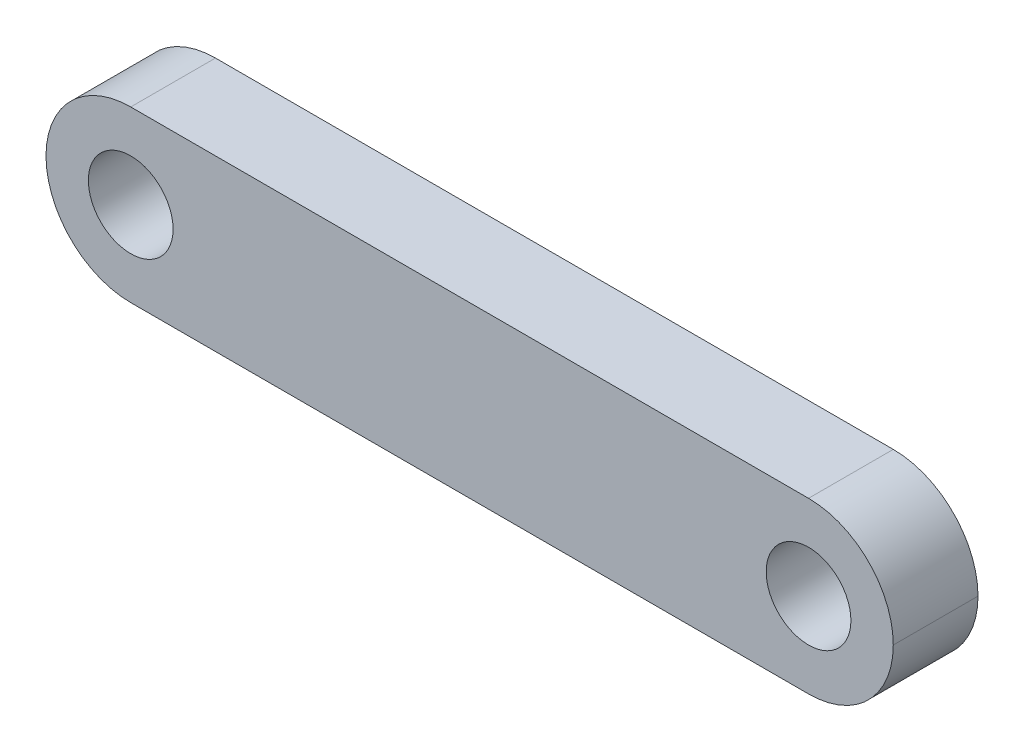
ISO-10303-21;
HEADER;
FILE_DESCRIPTION(('STEP AP214'),'2;1');
FILE_NAME('part.step','',(''),(''),'','','');
FILE_SCHEMA(('AUTOMOTIVE_DESIGN { 1 0 10303 214 1 1 1 1 }'));
ENDSEC;
DATA;
#1=APPLICATION_CONTEXT('core data for automotive mechanical design processes');
#2=APPLICATION_PROTOCOL_DEFINITION('international standard','automotive_design',2000,#1);
#3=PRODUCT_CONTEXT('',#1,'mechanical');
#4=PRODUCT('Part','Part','',(#3));
#5=PRODUCT_RELATED_PRODUCT_CATEGORY('part','',(#4));
#6=PRODUCT_DEFINITION_FORMATION('','',#4);
#7=PRODUCT_DEFINITION_CONTEXT('part definition',#1,'design');
#8=PRODUCT_DEFINITION('design','',#6,#7);
#9=PRODUCT_DEFINITION_SHAPE('','',#8);
#10=(LENGTH_UNIT() NAMED_UNIT(*) SI_UNIT(.MILLI.,.METRE.));
#11=(NAMED_UNIT(*) PLANE_ANGLE_UNIT() SI_UNIT($,.RADIAN.));
#12=(NAMED_UNIT(*) SI_UNIT($,.STERADIAN.) SOLID_ANGLE_UNIT());
#13=UNCERTAINTY_MEASURE_WITH_UNIT(LENGTH_MEASURE(1.E-05),#10,'distance_accuracy_value','');
#14=(GEOMETRIC_REPRESENTATION_CONTEXT(3) GLOBAL_UNCERTAINTY_ASSIGNED_CONTEXT((#13)) GLOBAL_UNIT_ASSIGNED_CONTEXT((#10,
#11,#12)) REPRESENTATION_CONTEXT('',''));
#15=CARTESIAN_POINT('',(0.,0.,0.));
#16=DIRECTION('',(0.,0.,1.));
#17=DIRECTION('',(1.,0.,0.));
#18=AXIS2_PLACEMENT_3D('',#15,#16,#17);
#19=CARTESIAN_POINT('',(0.,0.,10.));
#20=DIRECTION('',(0.,1.,0.));
#21=DIRECTION('',(0.,0.,1.));
#22=AXIS2_PLACEMENT_3D('',#19,#20,#21);
#23=PLANE('',#22);
#24=DIRECTION('',(1.,0.,0.));
#25=VECTOR('',#24,1.);
#26=CARTESIAN_POINT('',(0.,0.,0.));
#27=LINE('',#26,#25);
#28=CARTESIAN_POINT('',(10.,0.,0.));
#29=VERTEX_POINT('',#28);
#30=CARTESIAN_POINT('',(90.,0.,0.));
#31=VERTEX_POINT('',#30);
#32=EDGE_CURVE('E124',#29,#31,#27,.T.);
#33=ORIENTED_EDGE('',*,*,#32,.T.);
#34=DIRECTION('',(0.,0.,-1.));
#35=VECTOR('',#34,1.);
#36=CARTESIAN_POINT('',(90.,0.,10.));
#37=LINE('',#36,#35);
#38=CARTESIAN_POINT('',(90.,0.,10.));
#39=VERTEX_POINT('',#38);
#40=EDGE_CURVE('E11',#31,#39,#37,.F.);
#41=ORIENTED_EDGE('',*,*,#40,.T.);
#42=DIRECTION('',(1.,0.,0.));
#43=VECTOR('',#42,1.);
#44=CARTESIAN_POINT('',(0.,0.,10.));
#45=LINE('',#44,#43);
#46=CARTESIAN_POINT('',(10.,0.,10.));
#47=VERTEX_POINT('',#46);
#48=EDGE_CURVE('E123',#47,#39,#45,.T.);
#49=ORIENTED_EDGE('',*,*,#48,.F.);
#50=DIRECTION('',(0.,0.,-1.));
#51=VECTOR('',#50,1.);
#52=CARTESIAN_POINT('',(10.,0.,10.));
#53=LINE('',#52,#51);
#54=EDGE_CURVE('E52',#47,#29,#53,.T.);
#55=ORIENTED_EDGE('',*,*,#54,.T.);
#56=EDGE_LOOP('',(#33,#41,#49,#55));
#57=FACE_BOUND('',#56,.T.);
#58=ADVANCED_FACE('F43',(#57),#23,.F.);
#59=CARTESIAN_POINT('',(0.,20.,10.));
#60=DIRECTION('',(0.,-1.,0.));
#61=DIRECTION('',(0.,0.,-1.));
#62=AXIS2_PLACEMENT_3D('',#59,#60,#61);
#63=PLANE('',#62);
#64=DIRECTION('',(-1.,0.,0.));
#65=VECTOR('',#64,1.);
#66=CARTESIAN_POINT('',(0.,20.,10.));
#67=LINE('',#66,#65);
#68=CARTESIAN_POINT('',(90.,20.,10.));
#69=VERTEX_POINT('',#68);
#70=CARTESIAN_POINT('',(10.,20.,10.));
#71=VERTEX_POINT('',#70);
#72=EDGE_CURVE('E117',#69,#71,#67,.T.);
#73=ORIENTED_EDGE('',*,*,#72,.F.);
#74=DIRECTION('',(0.,0.,-1.));
#75=VECTOR('',#74,1.);
#76=CARTESIAN_POINT('',(90.,20.,10.));
#77=LINE('',#76,#75);
#78=CARTESIAN_POINT('',(90.,20.,0.));
#79=VERTEX_POINT('',#78);
#80=EDGE_CURVE('E102',#69,#79,#77,.T.);
#81=ORIENTED_EDGE('',*,*,#80,.T.);
#82=DIRECTION('',(-1.,0.,0.));
#83=VECTOR('',#82,1.);
#84=CARTESIAN_POINT('',(0.,20.,0.));
#85=LINE('',#84,#83);
#86=CARTESIAN_POINT('',(10.,20.,0.));
#87=VERTEX_POINT('',#86);
#88=EDGE_CURVE('E114',#79,#87,#85,.T.);
#89=ORIENTED_EDGE('',*,*,#88,.T.);
#90=DIRECTION('',(0.,0.,-1.));
#91=VECTOR('',#90,1.);
#92=CARTESIAN_POINT('',(10.,20.,10.));
#93=LINE('',#92,#91);
#94=EDGE_CURVE('E119',#87,#71,#93,.F.);
#95=ORIENTED_EDGE('',*,*,#94,.T.);
#96=EDGE_LOOP('',(#73,#81,#89,#95));
#97=FACE_BOUND('',#96,.T.);
#98=ADVANCED_FACE('F113',(#97),#63,.F.);
#99=CARTESIAN_POINT('',(0.,0.,10.));
#100=DIRECTION('',(0.,0.,-1.));
#101=DIRECTION('',(-1.,0.,0.));
#102=AXIS2_PLACEMENT_3D('',#99,#100,#101);
#103=PLANE('',#102);
#104=CARTESIAN_POINT('',(90.,10.,10.));
#105=DIRECTION('',(0.,0.,1.));
#106=DIRECTION('',(1.,0.,0.));
#107=AXIS2_PLACEMENT_3D('',#104,#105,#106);
#108=CIRCLE('',#107,5.);
#109=CARTESIAN_POINT('',(95.,10.,10.));
#110=VERTEX_POINT('',#109);
#111=EDGE_CURVE('E157',#110,#110,#108,.T.);
#112=ORIENTED_EDGE('',*,*,#111,.F.);
#113=EDGE_LOOP('',(#112));
#114=FACE_BOUND('',#113,.T.);
#115=CARTESIAN_POINT('',(10.,10.,10.));
#116=DIRECTION('',(0.,0.,1.));
#117=DIRECTION('',(1.,0.,0.));
#118=AXIS2_PLACEMENT_3D('',#115,#116,#117);
#119=CIRCLE('',#118,5.);
#120=CARTESIAN_POINT('',(15.,10.,10.));
#121=VERTEX_POINT('',#120);
#122=EDGE_CURVE('E149',#121,#121,#119,.T.);
#123=ORIENTED_EDGE('',*,*,#122,.F.);
#124=EDGE_LOOP('',(#123));
#125=FACE_BOUND('',#124,.T.);
#126=CARTESIAN_POINT('',(90.,10.,10.));
#127=DIRECTION('',(0.,0.,-1.));
#128=DIRECTION('',(-1.,0.,0.));
#129=AXIS2_PLACEMENT_3D('',#126,#127,#128);
#130=CIRCLE('',#129,10.);
#131=CARTESIAN_POINT('',(100.,10.,10.));
#132=VERTEX_POINT('',#131);
#133=EDGE_CURVE('E60',#39,#132,#130,.F.);
#134=ORIENTED_EDGE('',*,*,#133,.T.);
#135=CARTESIAN_POINT('',(90.,10.,10.));
#136=DIRECTION('',(0.,0.,-1.));
#137=DIRECTION('',(-1.,0.,0.));
#138=AXIS2_PLACEMENT_3D('',#135,#136,#137);
#139=CIRCLE('',#138,10.);
#140=EDGE_CURVE('E139',#132,#69,#139,.F.);
#141=ORIENTED_EDGE('',*,*,#140,.T.);
#142=ORIENTED_EDGE('',*,*,#72,.T.);
#143=CARTESIAN_POINT('',(10.,10.,10.));
#144=DIRECTION('',(0.,0.,-1.));
#145=DIRECTION('',(-1.,0.,0.));
#146=AXIS2_PLACEMENT_3D('',#143,#144,#145);
#147=CIRCLE('',#146,10.);
#148=CARTESIAN_POINT('',(0.,10.,10.));
#149=VERTEX_POINT('',#148);
#150=EDGE_CURVE('E107',#71,#149,#147,.F.);
#151=ORIENTED_EDGE('',*,*,#150,.T.);
#152=CARTESIAN_POINT('',(10.,10.,10.));
#153=DIRECTION('',(0.,0.,-1.));
#154=DIRECTION('',(-1.,0.,0.));
#155=AXIS2_PLACEMENT_3D('',#152,#153,#154);
#156=CIRCLE('',#155,10.);
#157=EDGE_CURVE('E136',#149,#47,#156,.F.);
#158=ORIENTED_EDGE('',*,*,#157,.T.);
#159=ORIENTED_EDGE('',*,*,#48,.T.);
#160=EDGE_LOOP('',(#134,#141,#142,#151,#158,#159));
#161=FACE_BOUND('',#160,.T.);
#162=ADVANCED_FACE('F160',(#114,#125,#161),#103,.F.);
#163=CARTESIAN_POINT('',(0.,0.,0.));
#164=DIRECTION('',(0.,0.,-1.));
#165=DIRECTION('',(-1.,0.,0.));
#166=AXIS2_PLACEMENT_3D('',#163,#164,#165);
#167=PLANE('',#166);
#168=CARTESIAN_POINT('',(90.,10.,0.));
#169=DIRECTION('',(0.,0.,1.));
#170=DIRECTION('',(1.,0.,0.));
#171=AXIS2_PLACEMENT_3D('',#168,#169,#170);
#172=CIRCLE('',#171,5.);
#173=CARTESIAN_POINT('',(95.,10.,0.));
#174=VERTEX_POINT('',#173);
#175=EDGE_CURVE('E154',#174,#174,#172,.T.);
#176=ORIENTED_EDGE('',*,*,#175,.T.);
#177=EDGE_LOOP('',(#176));
#178=FACE_BOUND('',#177,.T.);
#179=CARTESIAN_POINT('',(10.,10.,0.));
#180=DIRECTION('',(0.,0.,1.));
#181=DIRECTION('',(1.,0.,0.));
#182=AXIS2_PLACEMENT_3D('',#179,#180,#181);
#183=CIRCLE('',#182,5.);
#184=CARTESIAN_POINT('',(15.,10.,0.));
#185=VERTEX_POINT('',#184);
#186=EDGE_CURVE('E144',#185,#185,#183,.T.);
#187=ORIENTED_EDGE('',*,*,#186,.T.);
#188=EDGE_LOOP('',(#187));
#189=FACE_BOUND('',#188,.T.);
#190=ORIENTED_EDGE('',*,*,#88,.F.);
#191=CARTESIAN_POINT('',(90.,10.,0.));
#192=DIRECTION('',(0.,0.,-1.));
#193=DIRECTION('',(-1.,0.,0.));
#194=AXIS2_PLACEMENT_3D('',#191,#192,#193);
#195=CIRCLE('',#194,10.);
#196=CARTESIAN_POINT('',(100.,10.,0.));
#197=VERTEX_POINT('',#196);
#198=EDGE_CURVE('E98',#79,#197,#195,.T.);
#199=ORIENTED_EDGE('',*,*,#198,.T.);
#200=CARTESIAN_POINT('',(90.,10.,0.));
#201=DIRECTION('',(0.,0.,-1.));
#202=DIRECTION('',(-1.,0.,0.));
#203=AXIS2_PLACEMENT_3D('',#200,#201,#202);
#204=CIRCLE('',#203,10.);
#205=EDGE_CURVE('E108',#197,#31,#204,.T.);
#206=ORIENTED_EDGE('',*,*,#205,.T.);
#207=ORIENTED_EDGE('',*,*,#32,.F.);
#208=CARTESIAN_POINT('',(10.,10.,0.));
#209=DIRECTION('',(0.,0.,-1.));
#210=DIRECTION('',(-1.,0.,0.));
#211=AXIS2_PLACEMENT_3D('',#208,#209,#210);
#212=CIRCLE('',#211,10.);
#213=CARTESIAN_POINT('',(0.,10.,0.));
#214=VERTEX_POINT('',#213);
#215=EDGE_CURVE('E132',#29,#214,#212,.T.);
#216=ORIENTED_EDGE('',*,*,#215,.T.);
#217=CARTESIAN_POINT('',(10.,10.,0.));
#218=DIRECTION('',(0.,0.,-1.));
#219=DIRECTION('',(-1.,0.,0.));
#220=AXIS2_PLACEMENT_3D('',#217,#218,#219);
#221=CIRCLE('',#220,10.);
#222=EDGE_CURVE('E118',#214,#87,#221,.T.);
#223=ORIENTED_EDGE('',*,*,#222,.T.);
#224=EDGE_LOOP('',(#190,#199,#206,#207,#216,#223));
#225=FACE_BOUND('',#224,.T.);
#226=ADVANCED_FACE('F121',(#178,#189,#225),#167,.T.);
#227=CARTESIAN_POINT('',(90.,10.,10.));
#228=DIRECTION('',(0.,0.,-1.));
#229=DIRECTION('',(-1.,0.,0.));
#230=AXIS2_PLACEMENT_3D('',#227,#228,#229);
#231=CYLINDRICAL_SURFACE('',#230,10.);
#232=DIRECTION('',(0.,0.,-1.));
#233=VECTOR('',#232,1.);
#234=CARTESIAN_POINT('',(100.,10.,10.));
#235=LINE('',#234,#233);
#236=EDGE_CURVE('E103',#132,#197,#235,.T.);
#237=ORIENTED_EDGE('',*,*,#236,.F.);
#238=ORIENTED_EDGE('',*,*,#133,.F.);
#239=ORIENTED_EDGE('',*,*,#40,.F.);
#240=ORIENTED_EDGE('',*,*,#205,.F.);
#241=EDGE_LOOP('',(#237,#238,#239,#240));
#242=FACE_BOUND('',#241,.T.);
#243=ADVANCED_FACE('F166',(#242),#231,.T.);
#244=CARTESIAN_POINT('',(90.,10.,10.));
#245=DIRECTION('',(0.,0.,-1.));
#246=DIRECTION('',(-1.,0.,0.));
#247=AXIS2_PLACEMENT_3D('',#244,#245,#246);
#248=CYLINDRICAL_SURFACE('',#247,10.);
#249=ORIENTED_EDGE('',*,*,#140,.F.);
#250=ORIENTED_EDGE('',*,*,#236,.T.);
#251=ORIENTED_EDGE('',*,*,#198,.F.);
#252=ORIENTED_EDGE('',*,*,#80,.F.);
#253=EDGE_LOOP('',(#249,#250,#251,#252));
#254=FACE_BOUND('',#253,.T.);
#255=ADVANCED_FACE('F101',(#254),#248,.T.);
#256=CARTESIAN_POINT('',(10.,10.,10.));
#257=DIRECTION('',(0.,0.,-1.));
#258=DIRECTION('',(-1.,0.,0.));
#259=AXIS2_PLACEMENT_3D('',#256,#257,#258);
#260=CYLINDRICAL_SURFACE('',#259,10.);
#261=DIRECTION('',(0.,0.,-1.));
#262=VECTOR('',#261,1.);
#263=CARTESIAN_POINT('',(0.,10.,10.));
#264=LINE('',#263,#262);
#265=EDGE_CURVE('E47',#149,#214,#264,.T.);
#266=ORIENTED_EDGE('',*,*,#265,.F.);
#267=ORIENTED_EDGE('',*,*,#150,.F.);
#268=ORIENTED_EDGE('',*,*,#94,.F.);
#269=ORIENTED_EDGE('',*,*,#222,.F.);
#270=EDGE_LOOP('',(#266,#267,#268,#269));
#271=FACE_BOUND('',#270,.T.);
#272=ADVANCED_FACE('F45',(#271),#260,.T.);
#273=CARTESIAN_POINT('',(10.,10.,10.));
#274=DIRECTION('',(0.,0.,-1.));
#275=DIRECTION('',(-1.,0.,0.));
#276=AXIS2_PLACEMENT_3D('',#273,#274,#275);
#277=CYLINDRICAL_SURFACE('',#276,10.);
#278=ORIENTED_EDGE('',*,*,#157,.F.);
#279=ORIENTED_EDGE('',*,*,#265,.T.);
#280=ORIENTED_EDGE('',*,*,#215,.F.);
#281=ORIENTED_EDGE('',*,*,#54,.F.);
#282=EDGE_LOOP('',(#278,#279,#280,#281));
#283=FACE_BOUND('',#282,.T.);
#284=ADVANCED_FACE('F163',(#283),#277,.T.);
#285=CARTESIAN_POINT('',(10.,10.,0.));
#286=DIRECTION('',(0.,0.,1.));
#287=DIRECTION('',(1.,0.,0.));
#288=AXIS2_PLACEMENT_3D('',#285,#286,#287);
#289=CYLINDRICAL_SURFACE('',#288,5.);
#290=ORIENTED_EDGE('',*,*,#186,.F.);
#291=EDGE_LOOP('',(#290));
#292=FACE_BOUND('',#291,.T.);
#293=ORIENTED_EDGE('',*,*,#122,.T.);
#294=EDGE_LOOP('',(#293));
#295=FACE_BOUND('',#294,.T.);
#296=ADVANCED_FACE('F186',(#292,#295),#289,.F.);
#297=CARTESIAN_POINT('',(90.,10.,0.));
#298=DIRECTION('',(0.,0.,1.));
#299=DIRECTION('',(1.,0.,0.));
#300=AXIS2_PLACEMENT_3D('',#297,#298,#299);
#301=CYLINDRICAL_SURFACE('',#300,5.);
#302=ORIENTED_EDGE('',*,*,#175,.F.);
#303=EDGE_LOOP('',(#302));
#304=FACE_BOUND('',#303,.T.);
#305=ORIENTED_EDGE('',*,*,#111,.T.);
#306=EDGE_LOOP('',(#305));
#307=FACE_BOUND('',#306,.T.);
#308=ADVANCED_FACE('F189',(#304,#307),#301,.F.);
#309=CLOSED_SHELL('',(#58,#98,#162,#226,#243,#255,#272,#284,#296,#308));
#310=MANIFOLD_SOLID_BREP('B2',#309);
#311=ADVANCED_BREP_SHAPE_REPRESENTATION('',(#18,#310),#14);
#312=SHAPE_DEFINITION_REPRESENTATION(#9,#311);
ENDSEC;
END-ISO-10303-21;
